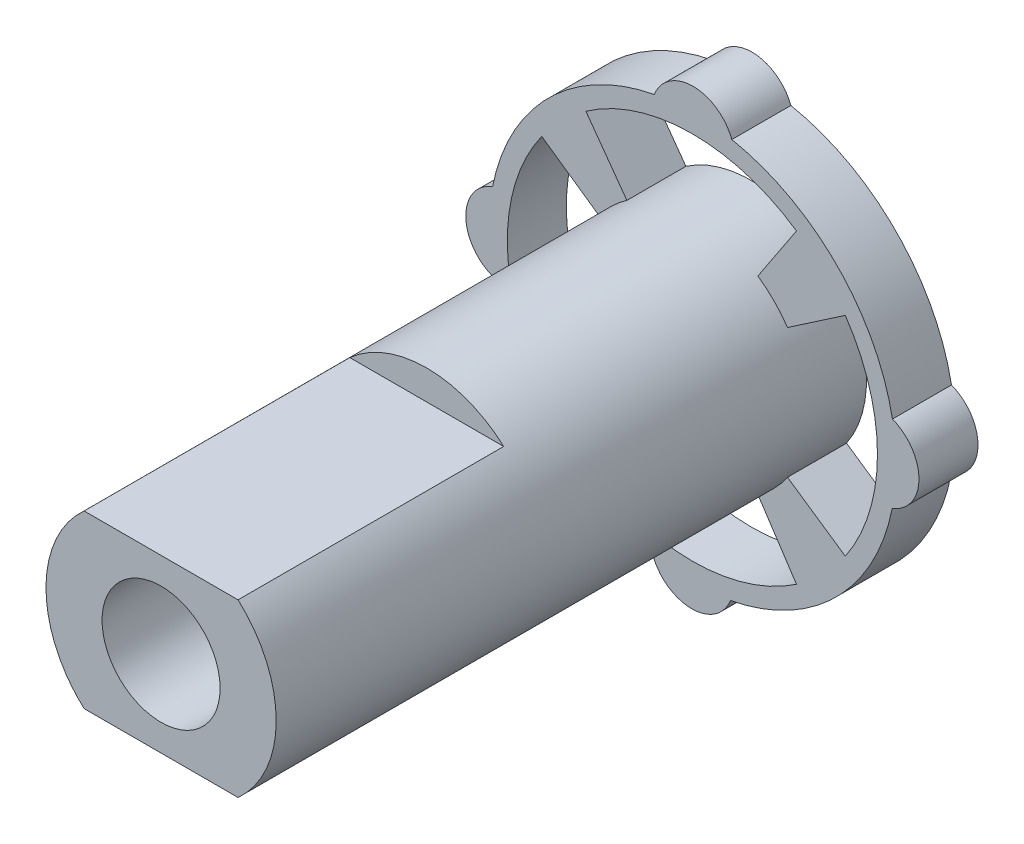
ISO-10303-21;
HEADER;
FILE_DESCRIPTION(('STEP AP214'),'2;1');
FILE_NAME('part.step','',(''),(''),'','','');
FILE_SCHEMA(('AUTOMOTIVE_DESIGN { 1 0 10303 214 1 1 1 1 }'));
ENDSEC;
DATA;
#1=APPLICATION_CONTEXT('core data for automotive mechanical design processes');
#2=APPLICATION_PROTOCOL_DEFINITION('international standard','automotive_design',2000,#1);
#3=PRODUCT_CONTEXT('',#1,'mechanical');
#4=PRODUCT('Part','Part','',(#3));
#5=PRODUCT_RELATED_PRODUCT_CATEGORY('part','',(#4));
#6=PRODUCT_DEFINITION_FORMATION('','',#4);
#7=PRODUCT_DEFINITION_CONTEXT('part definition',#1,'design');
#8=PRODUCT_DEFINITION('design','',#6,#7);
#9=PRODUCT_DEFINITION_SHAPE('','',#8);
#10=(LENGTH_UNIT() NAMED_UNIT(*) SI_UNIT(.MILLI.,.METRE.));
#11=(NAMED_UNIT(*) PLANE_ANGLE_UNIT() SI_UNIT($,.RADIAN.));
#12=(NAMED_UNIT(*) SI_UNIT($,.STERADIAN.) SOLID_ANGLE_UNIT());
#13=UNCERTAINTY_MEASURE_WITH_UNIT(LENGTH_MEASURE(1.E-05),#10,'distance_accuracy_value','');
#14=(GEOMETRIC_REPRESENTATION_CONTEXT(3) GLOBAL_UNCERTAINTY_ASSIGNED_CONTEXT((#13)) GLOBAL_UNIT_ASSIGNED_CONTEXT((#10,
#11,#12)) REPRESENTATION_CONTEXT('',''));
#15=CARTESIAN_POINT('',(0.,0.,0.));
#16=DIRECTION('',(0.,0.,1.));
#17=DIRECTION('',(1.,0.,0.));
#18=AXIS2_PLACEMENT_3D('',#15,#16,#17);
#19=CARTESIAN_POINT('',(0.,0.,5.));
#20=DIRECTION('',(0.,0.,-1.));
#21=DIRECTION('',(-1.,0.,0.));
#22=AXIS2_PLACEMENT_3D('',#19,#20,#21);
#23=CYLINDRICAL_SURFACE('',#22,1.95);
#24=CARTESIAN_POINT('',(0.,0.,5.));
#25=DIRECTION('',(0.,0.,1.));
#26=DIRECTION('',(1.,0.,0.));
#27=AXIS2_PLACEMENT_3D('',#24,#25,#26);
#28=CIRCLE('',#27,1.95);
#29=CARTESIAN_POINT('',(-1.30384048104053,1.45,5.));
#30=VERTEX_POINT('',#29);
#31=CARTESIAN_POINT('',(-1.30384048104053,-1.45,5.));
#32=VERTEX_POINT('',#31);
#33=EDGE_CURVE('E226',#30,#32,#28,.T.);
#34=ORIENTED_EDGE('',*,*,#33,.F.);
#35=DIRECTION('',(0.,0.,-1.));
#36=VECTOR('',#35,1.);
#37=CARTESIAN_POINT('',(-1.30384048104053,1.45,5.));
#38=LINE('',#37,#36);
#39=CARTESIAN_POINT('',(-1.30384048104053,1.45,0.5));
#40=VERTEX_POINT('',#39);
#41=EDGE_CURVE('E56',#30,#40,#38,.T.);
#42=ORIENTED_EDGE('',*,*,#41,.T.);
#43=CARTESIAN_POINT('',(0.,0.,0.5));
#44=DIRECTION('',(0.,0.,1.));
#45=DIRECTION('',(1.,0.,0.));
#46=AXIS2_PLACEMENT_3D('',#43,#44,#45);
#47=CIRCLE('',#46,1.95);
#48=CARTESIAN_POINT('',(1.30384048104053,1.45,0.5));
#49=VERTEX_POINT('',#48);
#50=EDGE_CURVE('E11',#49,#40,#47,.T.);
#51=ORIENTED_EDGE('',*,*,#50,.F.);
#52=DIRECTION('',(0.,0.,-1.));
#53=VECTOR('',#52,1.);
#54=CARTESIAN_POINT('',(1.30384048104053,1.45,5.));
#55=LINE('',#54,#53);
#56=CARTESIAN_POINT('',(1.30384048104053,1.45,5.));
#57=VERTEX_POINT('',#56);
#58=EDGE_CURVE('E252',#49,#57,#55,.F.);
#59=ORIENTED_EDGE('',*,*,#58,.T.);
#60=CARTESIAN_POINT('',(1.30384048104053,-1.45,5.));
#61=VERTEX_POINT('',#60);
#62=EDGE_CURVE('E236',#61,#57,#28,.T.);
#63=ORIENTED_EDGE('',*,*,#62,.F.);
#64=DIRECTION('',(0.,0.,-1.));
#65=VECTOR('',#64,1.);
#66=CARTESIAN_POINT('',(1.30384048104053,-1.45,5.));
#67=LINE('',#66,#65);
#68=CARTESIAN_POINT('',(1.30384048104053,-1.45,0.5));
#69=VERTEX_POINT('',#68);
#70=EDGE_CURVE('E48',#61,#69,#67,.T.);
#71=ORIENTED_EDGE('',*,*,#70,.T.);
#72=CARTESIAN_POINT('',(0.,0.,0.5));
#73=DIRECTION('',(0.,0.,1.));
#74=DIRECTION('',(1.,0.,0.));
#75=AXIS2_PLACEMENT_3D('',#72,#73,#74);
#76=CIRCLE('',#75,1.95);
#77=CARTESIAN_POINT('',(-1.30384048104053,-1.45,0.5));
#78=VERTEX_POINT('',#77);
#79=EDGE_CURVE('E41',#78,#69,#76,.T.);
#80=ORIENTED_EDGE('',*,*,#79,.F.);
#81=DIRECTION('',(0.,0.,-1.));
#82=VECTOR('',#81,1.);
#83=CARTESIAN_POINT('',(-1.30384048104053,-1.45,5.));
#84=LINE('',#83,#82);
#85=EDGE_CURVE('E219',#78,#32,#84,.F.);
#86=ORIENTED_EDGE('',*,*,#85,.T.);
#87=EDGE_LOOP('',(#34,#42,#51,#59,#63,#71,#80,#86));
#88=FACE_BOUND('',#87,.T.);
#89=DIRECTION('',(0.,0.,-1.));
#90=VECTOR('',#89,1.);
#91=CARTESIAN_POINT('',(-1.61113218441836,-1.09852313782514,-4.));
#92=LINE('',#91,#90);
#93=CARTESIAN_POINT('',(-1.61113218441712,-1.09852313782429,-4.));
#94=VERTEX_POINT('',#93);
#95=CARTESIAN_POINT('',(-1.61113218441712,-1.09852313782429,-5.));
#96=VERTEX_POINT('',#95);
#97=EDGE_CURVE('E344',#94,#96,#92,.T.);
#98=ORIENTED_EDGE('',*,*,#97,.F.);
#99=CARTESIAN_POINT('',(0.,0.,-4.));
#100=DIRECTION('',(0.,0.,-1.));
#101=DIRECTION('',(-1.,0.,0.));
#102=AXIS2_PLACEMENT_3D('',#99,#100,#101);
#103=CIRCLE('',#102,1.95000000000151);
#104=CARTESIAN_POINT('',(-1.10963609074517,-1.6034985956095,-4.));
#105=VERTEX_POINT('',#104);
#106=EDGE_CURVE('E301',#105,#94,#103,.T.);
#107=ORIENTED_EDGE('',*,*,#106,.F.);
#108=DIRECTION('',(0.,0.,-1.));
#109=VECTOR('',#108,1.);
#110=CARTESIAN_POINT('',(-1.10963609074517,-1.6034985956095,-4.));
#111=LINE('',#110,#109);
#112=CARTESIAN_POINT('',(-1.10963609074434,-1.60349859560824,-5.));
#113=VERTEX_POINT('',#112);
#114=EDGE_CURVE('E347',#105,#113,#111,.T.);
#115=ORIENTED_EDGE('',*,*,#114,.T.);
#116=CARTESIAN_POINT('',(0.,0.,-5.));
#117=DIRECTION('',(0.,0.,1.));
#118=DIRECTION('',(1.,0.,0.));
#119=AXIS2_PLACEMENT_3D('',#116,#117,#118);
#120=CIRCLE('',#119,1.95);
#121=CARTESIAN_POINT('',(1.10963609074434,-1.60349859560824,-5.));
#122=VERTEX_POINT('',#121);
#123=EDGE_CURVE('E244',#113,#122,#120,.T.);
#124=ORIENTED_EDGE('',*,*,#123,.T.);
#125=DIRECTION('',(0.,0.,-1.));
#126=VECTOR('',#125,1.);
#127=CARTESIAN_POINT('',(1.10963609074518,-1.6034985956095,-4.));
#128=LINE('',#127,#126);
#129=CARTESIAN_POINT('',(1.10963609074432,-1.60349859560826,-4.));
#130=VERTEX_POINT('',#129);
#131=EDGE_CURVE('E353',#130,#122,#128,.T.);
#132=ORIENTED_EDGE('',*,*,#131,.F.);
#133=CARTESIAN_POINT('',(0.,0.,-4.));
#134=DIRECTION('',(0.,0.,-1.));
#135=DIRECTION('',(-1.,0.,0.));
#136=AXIS2_PLACEMENT_3D('',#133,#134,#135);
#137=CIRCLE('',#136,1.95000000000151);
#138=CARTESIAN_POINT('',(1.61113218441836,-1.09852313782514,-4.));
#139=VERTEX_POINT('',#138);
#140=EDGE_CURVE('E289',#139,#130,#137,.T.);
#141=ORIENTED_EDGE('',*,*,#140,.F.);
#142=DIRECTION('',(0.,0.,-1.));
#143=VECTOR('',#142,1.);
#144=CARTESIAN_POINT('',(1.61113218441836,-1.09852313782514,-4.));
#145=LINE('',#144,#143);
#146=CARTESIAN_POINT('',(1.61113218441712,-1.09852313782429,-5.));
#147=VERTEX_POINT('',#146);
#148=EDGE_CURVE('E356',#139,#147,#145,.T.);
#149=ORIENTED_EDGE('',*,*,#148,.T.);
#150=CARTESIAN_POINT('',(1.61113218441712,1.09852313782429,-5.));
#151=VERTEX_POINT('',#150);
#152=EDGE_CURVE('E243',#147,#151,#120,.T.);
#153=ORIENTED_EDGE('',*,*,#152,.T.);
#154=DIRECTION('',(0.,0.,-1.));
#155=VECTOR('',#154,1.);
#156=CARTESIAN_POINT('',(1.61113218441836,1.09852313782514,-4.));
#157=LINE('',#156,#155);
#158=CARTESIAN_POINT('',(1.61113218441712,1.09852313782429,-4.));
#159=VERTEX_POINT('',#158);
#160=EDGE_CURVE('E362',#159,#151,#157,.T.);
#161=ORIENTED_EDGE('',*,*,#160,.F.);
#162=CARTESIAN_POINT('',(0.,0.,-4.));
#163=DIRECTION('',(0.,0.,-1.));
#164=DIRECTION('',(-1.,0.,0.));
#165=AXIS2_PLACEMENT_3D('',#162,#163,#164);
#166=CIRCLE('',#165,1.95000000000151);
#167=CARTESIAN_POINT('',(1.10963609074517,1.6034985956095,-4.));
#168=VERTEX_POINT('',#167);
#169=EDGE_CURVE('E277',#168,#159,#166,.T.);
#170=ORIENTED_EDGE('',*,*,#169,.F.);
#171=DIRECTION('',(0.,0.,-1.));
#172=VECTOR('',#171,1.);
#173=CARTESIAN_POINT('',(1.10963609074517,1.6034985956095,-4.));
#174=LINE('',#173,#172);
#175=CARTESIAN_POINT('',(1.10963609074434,1.60349859560825,-5.));
#176=VERTEX_POINT('',#175);
#177=EDGE_CURVE('E365',#168,#176,#174,.T.);
#178=ORIENTED_EDGE('',*,*,#177,.T.);
#179=CARTESIAN_POINT('',(-1.10963609074431,1.60349859560827,-5.));
#180=VERTEX_POINT('',#179);
#181=EDGE_CURVE('E238',#176,#180,#120,.T.);
#182=ORIENTED_EDGE('',*,*,#181,.T.);
#183=DIRECTION('',(0.,0.,-1.));
#184=VECTOR('',#183,1.);
#185=CARTESIAN_POINT('',(-1.10963609074519,1.60349859560949,-4.));
#186=LINE('',#185,#184);
#187=CARTESIAN_POINT('',(-1.10963609074433,1.60349859560825,-4.));
#188=VERTEX_POINT('',#187);
#189=EDGE_CURVE('E371',#188,#180,#186,.T.);
#190=ORIENTED_EDGE('',*,*,#189,.F.);
#191=CARTESIAN_POINT('',(0.,0.,-4.));
#192=DIRECTION('',(0.,0.,-1.));
#193=DIRECTION('',(-1.,0.,0.));
#194=AXIS2_PLACEMENT_3D('',#191,#192,#193);
#195=CIRCLE('',#194,1.95000000000151);
#196=CARTESIAN_POINT('',(-1.58000550504227,1.142839710564,-4.));
#197=VERTEX_POINT('',#196);
#198=EDGE_CURVE('E265',#197,#188,#195,.T.);
#199=ORIENTED_EDGE('',*,*,#198,.F.);
#200=DIRECTION('',(0.,0.,-1.));
#201=VECTOR('',#200,1.);
#202=CARTESIAN_POINT('',(-1.58000550504227,1.142839710564,-4.));
#203=LINE('',#202,#201);
#204=CARTESIAN_POINT('',(-1.58000550504103,1.14283971056314,-5.));
#205=VERTEX_POINT('',#204);
#206=EDGE_CURVE('E374',#197,#205,#203,.T.);
#207=ORIENTED_EDGE('',*,*,#206,.T.);
#208=EDGE_CURVE('E740',#205,#96,#120,.T.);
#209=ORIENTED_EDGE('',*,*,#208,.T.);
#210=EDGE_LOOP('',(#98,#107,#115,#124,#132,#141,#149,#153,#161,#170,#178,#182,#190,#199,#207,#209));
#211=FACE_BOUND('',#210,.T.);
#212=ADVANCED_FACE('F34',(#88,#211),#23,.T.);
#213=CARTESIAN_POINT('',(0.,0.,5.));
#214=DIRECTION('',(0.,0.,1.));
#215=DIRECTION('',(1.,0.,0.));
#216=AXIS2_PLACEMENT_3D('',#213,#214,#215);
#217=PLANE('',#216);
#218=DIRECTION('',(1.,0.,0.));
#219=VECTOR('',#218,1.);
#220=CARTESIAN_POINT('',(0.,1.45,5.));
#221=LINE('',#220,#219);
#222=EDGE_CURVE('E225',#30,#57,#221,.T.);
#223=ORIENTED_EDGE('',*,*,#222,.F.);
#224=ORIENTED_EDGE('',*,*,#33,.T.);
#225=DIRECTION('',(-1.,0.,0.));
#226=VECTOR('',#225,1.);
#227=CARTESIAN_POINT('',(0.,-1.45,5.));
#228=LINE('',#227,#226);
#229=EDGE_CURVE('E216',#61,#32,#228,.T.);
#230=ORIENTED_EDGE('',*,*,#229,.F.);
#231=ORIENTED_EDGE('',*,*,#62,.T.);
#232=EDGE_LOOP('',(#223,#224,#230,#231));
#233=FACE_BOUND('',#232,.T.);
#234=CARTESIAN_POINT('',(0.,0.,5.));
#235=DIRECTION('',(0.,0.,1.));
#236=DIRECTION('',(1.,0.,0.));
#237=AXIS2_PLACEMENT_3D('',#234,#235,#236);
#238=CIRCLE('',#237,1.);
#239=CARTESIAN_POINT('',(1.,0.,5.));
#240=VERTEX_POINT('',#239);
#241=EDGE_CURVE('E245',#240,#240,#238,.T.);
#242=ORIENTED_EDGE('',*,*,#241,.F.);
#243=EDGE_LOOP('',(#242));
#244=FACE_BOUND('',#243,.T.);
#245=ADVANCED_FACE('F234',(#233,#244),#217,.T.);
#246=CARTESIAN_POINT('',(0.,0.,-5.));
#247=DIRECTION('',(0.,0.,1.));
#248=DIRECTION('',(1.,0.,0.));
#249=AXIS2_PLACEMENT_3D('',#246,#247,#248);
#250=PLANE('',#249);
#251=ORIENTED_EDGE('',*,*,#181,.F.);
#252=DIRECTION('',(-0.551703079768003,-0.834040593601115,0.));
#253=VECTOR('',#252,1.);
#254=CARTESIAN_POINT('',(1.76362712142383,2.59217364100965,-5.));
#255=LINE('',#254,#253);
#256=CARTESIAN_POINT('',(1.76362712142383,2.59217364100965,-5.));
#257=VERTEX_POINT('',#256);
#258=EDGE_CURVE('E318',#257,#176,#255,.T.);
#259=ORIENTED_EDGE('',*,*,#258,.F.);
#260=CARTESIAN_POINT('',(0.,0.,-5.));
#261=DIRECTION('',(0.,0.,-1.));
#262=DIRECTION('',(-1.,0.,0.));
#263=AXIS2_PLACEMENT_3D('',#260,#261,#262);
#264=CIRCLE('',#263,3.13524238434079);
#265=CARTESIAN_POINT('',(-1.80412222564376,2.56415440321077,-5.));
#266=VERTEX_POINT('',#265);
#267=EDGE_CURVE('E315',#266,#257,#264,.T.);
#268=ORIENTED_EDGE('',*,*,#267,.F.);
#269=DIRECTION('',(-0.585867027483964,0.810407197714275,0.));
#270=VECTOR('',#269,1.);
#271=CARTESIAN_POINT('',(-1.80412222564376,2.56415440321077,-5.));
#272=LINE('',#271,#270);
#273=EDGE_CURVE('E312',#180,#266,#272,.T.);
#274=ORIENTED_EDGE('',*,*,#273,.F.);
#275=EDGE_LOOP('',(#251,#259,#268,#274));
#276=FACE_BOUND('',#275,.T.);
#277=DIRECTION('',(0.826042146891024,0.563608349441053,0.));
#278=VECTOR('',#277,1.);
#279=CARTESIAN_POINT('',(2.5901923790567,1.76653566282811,-5.));
#280=LINE('',#279,#278);
#281=CARTESIAN_POINT('',(2.5901923790567,1.76653566282811,-5.));
#282=VERTEX_POINT('',#281);
#283=EDGE_CURVE('E321',#151,#282,#280,.T.);
#284=ORIENTED_EDGE('',*,*,#283,.F.);
#285=ORIENTED_EDGE('',*,*,#152,.F.);
#286=DIRECTION('',(-0.826042146891024,0.563608349441053,0.));
#287=VECTOR('',#286,1.);
#288=CARTESIAN_POINT('',(2.5901923790567,-1.76653566282811,-5.));
#289=LINE('',#288,#287);
#290=CARTESIAN_POINT('',(2.5901923790567,-1.76653566282811,-5.));
#291=VERTEX_POINT('',#290);
#292=EDGE_CURVE('E327',#291,#147,#289,.T.);
#293=ORIENTED_EDGE('',*,*,#292,.F.);
#294=CARTESIAN_POINT('',(0.,0.,-5.));
#295=DIRECTION('',(0.,0.,-1.));
#296=DIRECTION('',(-1.,0.,0.));
#297=AXIS2_PLACEMENT_3D('',#294,#295,#296);
#298=CIRCLE('',#297,3.13524238434079);
#299=EDGE_CURVE('E324',#282,#291,#298,.T.);
#300=ORIENTED_EDGE('',*,*,#299,.F.);
#301=EDGE_LOOP('',(#284,#285,#293,#300));
#302=FACE_BOUND('',#301,.T.);
#303=DIRECTION('',(-0.826042146891024,-0.563608349441053,0.));
#304=VECTOR('',#303,1.);
#305=CARTESIAN_POINT('',(-2.5901923790567,-1.76653566282811,-5.));
#306=LINE('',#305,#304);
#307=CARTESIAN_POINT('',(-2.5901923790567,-1.76653566282811,-5.));
#308=VERTEX_POINT('',#307);
#309=EDGE_CURVE('E262',#96,#308,#306,.T.);
#310=ORIENTED_EDGE('',*,*,#309,.F.);
#311=ORIENTED_EDGE('',*,*,#208,.F.);
#312=DIRECTION('',(0.819868118333045,-0.5725524155403,0.));
#313=VECTOR('',#312,1.);
#314=CARTESIAN_POINT('',(-2.55183108765546,1.82151116072401,-5.));
#315=LINE('',#314,#313);
#316=CARTESIAN_POINT('',(-2.55183108765546,1.82151116072401,-5.));
#317=VERTEX_POINT('',#316);
#318=EDGE_CURVE('E309',#317,#205,#315,.T.);
#319=ORIENTED_EDGE('',*,*,#318,.F.);
#320=CARTESIAN_POINT('',(0.,0.,-5.));
#321=DIRECTION('',(0.,0.,-1.));
#322=DIRECTION('',(-1.,0.,0.));
#323=AXIS2_PLACEMENT_3D('',#320,#321,#322);
#324=CIRCLE('',#323,3.13524238434079);
#325=EDGE_CURVE('E257',#308,#317,#324,.T.);
#326=ORIENTED_EDGE('',*,*,#325,.F.);
#327=EDGE_LOOP('',(#310,#311,#319,#326));
#328=FACE_BOUND('',#327,.T.);
#329=ORIENTED_EDGE('',*,*,#123,.F.);
#330=DIRECTION('',(0.551703079768001,0.834040593601116,0.));
#331=VECTOR('',#330,1.);
#332=CARTESIAN_POINT('',(-1.76362712142383,-2.59217364100965,-5.));
#333=LINE('',#332,#331);
#334=CARTESIAN_POINT('',(-1.76362712142383,-2.59217364100965,-5.));
#335=VERTEX_POINT('',#334);
#336=EDGE_CURVE('E336',#335,#113,#333,.T.);
#337=ORIENTED_EDGE('',*,*,#336,.F.);
#338=CARTESIAN_POINT('',(0.,0.,-5.));
#339=DIRECTION('',(0.,0.,-1.));
#340=DIRECTION('',(-1.,0.,0.));
#341=AXIS2_PLACEMENT_3D('',#338,#339,#340);
#342=CIRCLE('',#341,3.13524238434079);
#343=CARTESIAN_POINT('',(1.76362712142383,-2.59217364100965,-5.));
#344=VERTEX_POINT('',#343);
#345=EDGE_CURVE('E333',#344,#335,#342,.T.);
#346=ORIENTED_EDGE('',*,*,#345,.F.);
#347=DIRECTION('',(0.551703079768001,-0.834040593601116,0.));
#348=VECTOR('',#347,1.);
#349=CARTESIAN_POINT('',(1.76362712142383,-2.59217364100965,-5.));
#350=LINE('',#349,#348);
#351=EDGE_CURVE('E330',#122,#344,#350,.T.);
#352=ORIENTED_EDGE('',*,*,#351,.F.);
#353=EDGE_LOOP('',(#329,#337,#346,#352));
#354=FACE_BOUND('',#353,.T.);
#355=CARTESIAN_POINT('',(0.,0.,-5.));
#356=DIRECTION('',(0.,0.,1.));
#357=DIRECTION('',(1.,0.,0.));
#358=AXIS2_PLACEMENT_3D('',#355,#356,#357);
#359=CIRCLE('',#358,1.);
#360=CARTESIAN_POINT('',(1.,0.,-5.));
#361=VERTEX_POINT('',#360);
#362=EDGE_CURVE('E241',#361,#361,#359,.T.);
#363=ORIENTED_EDGE('',*,*,#362,.T.);
#364=EDGE_LOOP('',(#363));
#365=FACE_BOUND('',#364,.T.);
#366=CARTESIAN_POINT('',(0.0107524234147472,3.13522394638059,-5.));
#367=DIRECTION('',(0.,0.,-1.));
#368=DIRECTION('',(1.,0.,0.));
#369=AXIS2_PLACEMENT_3D('',#366,#367,#368);
#370=CIRCLE('',#369,0.703048313630898);
#371=CARTESIAN_POINT('',(-0.644816381619679,3.38920519207598,-5.));
#372=VERTEX_POINT('',#371);
#373=CARTESIAN_POINT('',(0.668047872114337,3.38470265172042,-5.));
#374=VERTEX_POINT('',#373);
#375=EDGE_CURVE('E343',#372,#374,#370,.T.);
#376=ORIENTED_EDGE('',*,*,#375,.T.);
#377=CARTESIAN_POINT('',(0.,0.,-5.));
#378=DIRECTION('',(0.,0.,-1.));
#379=DIRECTION('',(-1.,0.,0.));
#380=AXIS2_PLACEMENT_3D('',#377,#378,#379);
#381=CIRCLE('',#380,3.44999999999997);
#382=CARTESIAN_POINT('',(3.38920519207596,0.644816381619676,-5.));
#383=VERTEX_POINT('',#382);
#384=EDGE_CURVE('E406',#374,#383,#381,.T.);
#385=ORIENTED_EDGE('',*,*,#384,.T.);
#386=CARTESIAN_POINT('',(3.13522394638056,-0.0107524234147479,-5.));
#387=DIRECTION('',(0.,0.,-1.));
#388=DIRECTION('',(1.,0.,0.));
#389=AXIS2_PLACEMENT_3D('',#386,#387,#388);
#390=CIRCLE('',#389,0.703048313630889);
#391=CARTESIAN_POINT('',(3.38470265172039,-0.66804787211434,-5.));
#392=VERTEX_POINT('',#391);
#393=EDGE_CURVE('E409',#383,#392,#390,.T.);
#394=ORIENTED_EDGE('',*,*,#393,.T.);
#395=CARTESIAN_POINT('',(0.,0.,-5.));
#396=DIRECTION('',(0.,0.,-1.));
#397=DIRECTION('',(-1.,0.,0.));
#398=AXIS2_PLACEMENT_3D('',#395,#396,#397);
#399=CIRCLE('',#398,3.44999999999995);
#400=CARTESIAN_POINT('',(0.644816381619673,-3.38920519207595,-5.));
#401=VERTEX_POINT('',#400);
#402=EDGE_CURVE('E412',#392,#401,#399,.T.);
#403=ORIENTED_EDGE('',*,*,#402,.T.);
#404=CARTESIAN_POINT('',(-0.0107524234147477,-3.13522394638056,-5.));
#405=DIRECTION('',(0.,0.,-1.));
#406=DIRECTION('',(1.,0.,0.));
#407=AXIS2_PLACEMENT_3D('',#404,#405,#406);
#408=CIRCLE('',#407,0.703048313630898);
#409=CARTESIAN_POINT('',(-0.668047872114338,-3.38470265172042,-5.));
#410=VERTEX_POINT('',#409);
#411=EDGE_CURVE('E415',#401,#410,#408,.T.);
#412=ORIENTED_EDGE('',*,*,#411,.T.);
#413=CARTESIAN_POINT('',(0.,0.,-5.));
#414=DIRECTION('',(0.,0.,-1.));
#415=DIRECTION('',(-1.,0.,0.));
#416=AXIS2_PLACEMENT_3D('',#413,#414,#415);
#417=CIRCLE('',#416,3.44999999999997);
#418=CARTESIAN_POINT('',(-3.38920519207596,-0.644816381619676,-5.));
#419=VERTEX_POINT('',#418);
#420=EDGE_CURVE('E418',#410,#419,#417,.T.);
#421=ORIENTED_EDGE('',*,*,#420,.T.);
#422=CARTESIAN_POINT('',(-3.13522394638058,0.0107524234147872,-5.));
#423=DIRECTION('',(0.,0.,-1.));
#424=DIRECTION('',(1.,0.,0.));
#425=AXIS2_PLACEMENT_3D('',#422,#423,#424);
#426=CIRCLE('',#425,0.703048313630892);
#427=CARTESIAN_POINT('',(-3.38470265172044,0.668047872114372,-5.));
#428=VERTEX_POINT('',#427);
#429=EDGE_CURVE('E421',#419,#428,#426,.T.);
#430=ORIENTED_EDGE('',*,*,#429,.T.);
#431=CARTESIAN_POINT('',(0.,0.,-5.));
#432=DIRECTION('',(0.,0.,-1.));
#433=DIRECTION('',(-1.,0.,0.));
#434=AXIS2_PLACEMENT_3D('',#431,#432,#433);
#435=CIRCLE('',#434,3.44999999999998);
#436=EDGE_CURVE('E382',#428,#372,#435,.T.);
#437=ORIENTED_EDGE('',*,*,#436,.T.);
#438=EDGE_LOOP('',(#376,#385,#394,#403,#412,#421,#430,#437));
#439=FACE_BOUND('',#438,.T.);
#440=ADVANCED_FACE('F446',(#276,#302,#328,#354,#365,#439),#250,.F.);
#441=CARTESIAN_POINT('',(0.,0.,5.));
#442=DIRECTION('',(0.,0.,-1.));
#443=DIRECTION('',(-1.,0.,0.));
#444=AXIS2_PLACEMENT_3D('',#441,#442,#443);
#445=CYLINDRICAL_SURFACE('',#444,1.);
#446=ORIENTED_EDGE('',*,*,#241,.T.);
#447=EDGE_LOOP('',(#446));
#448=FACE_BOUND('',#447,.T.);
#449=ORIENTED_EDGE('',*,*,#362,.F.);
#450=EDGE_LOOP('',(#449));
#451=FACE_BOUND('',#450,.T.);
#452=ADVANCED_FACE('F449',(#448,#451),#445,.F.);
#453=CARTESIAN_POINT('',(0.0107524234147472,3.13522394638059,-4.));
#454=DIRECTION('',(0.,0.,-1.));
#455=DIRECTION('',(-1.,0.,0.));
#456=AXIS2_PLACEMENT_3D('',#453,#454,#455);
#457=CYLINDRICAL_SURFACE('',#456,0.703048313630898);
#458=ORIENTED_EDGE('',*,*,#375,.F.);
#459=DIRECTION('',(0.,0.,-1.));
#460=VECTOR('',#459,1.);
#461=CARTESIAN_POINT('',(-0.644816381619679,3.38920519207598,-4.));
#462=LINE('',#461,#460);
#463=CARTESIAN_POINT('',(-0.644816381619679,3.38920519207598,-4.));
#464=VERTEX_POINT('',#463);
#465=EDGE_CURVE('E426',#464,#372,#462,.T.);
#466=ORIENTED_EDGE('',*,*,#465,.F.);
#467=CARTESIAN_POINT('',(0.0107524234147472,3.13522394638059,-4.));
#468=DIRECTION('',(0.,0.,-1.));
#469=DIRECTION('',(1.,0.,0.));
#470=AXIS2_PLACEMENT_3D('',#467,#468,#469);
#471=CIRCLE('',#470,0.703048313630898);
#472=CARTESIAN_POINT('',(0.668047872114337,3.38470265172042,-4.));
#473=VERTEX_POINT('',#472);
#474=EDGE_CURVE('E378',#464,#473,#471,.T.);
#475=ORIENTED_EDGE('',*,*,#474,.T.);
#476=DIRECTION('',(0.,0.,-1.));
#477=VECTOR('',#476,1.);
#478=CARTESIAN_POINT('',(0.668047872114337,3.38470265172042,-4.));
#479=LINE('',#478,#477);
#480=EDGE_CURVE('E403',#473,#374,#479,.T.);
#481=ORIENTED_EDGE('',*,*,#480,.T.);
#482=EDGE_LOOP('',(#458,#466,#475,#481));
#483=FACE_BOUND('',#482,.T.);
#484=ADVANCED_FACE('F451',(#483),#457,.T.);
#485=CARTESIAN_POINT('',(0.,0.,-4.));
#486=DIRECTION('',(0.,0.,-1.));
#487=DIRECTION('',(-1.,0.,0.));
#488=AXIS2_PLACEMENT_3D('',#485,#486,#487);
#489=CYLINDRICAL_SURFACE('',#488,3.44999999999998);
#490=ORIENTED_EDGE('',*,*,#436,.F.);
#491=DIRECTION('',(0.,0.,-1.));
#492=VECTOR('',#491,1.);
#493=CARTESIAN_POINT('',(-3.38470265172044,0.668047872114372,-4.));
#494=LINE('',#493,#492);
#495=CARTESIAN_POINT('',(-3.38470265172044,0.668047872114372,-4.));
#496=VERTEX_POINT('',#495);
#497=EDGE_CURVE('E428',#496,#428,#494,.T.);
#498=ORIENTED_EDGE('',*,*,#497,.F.);
#499=CARTESIAN_POINT('',(0.,0.,-4.));
#500=DIRECTION('',(0.,0.,-1.));
#501=DIRECTION('',(-1.,0.,0.));
#502=AXIS2_PLACEMENT_3D('',#499,#500,#501);
#503=CIRCLE('',#502,3.44999999999998);
#504=EDGE_CURVE('E400',#496,#464,#503,.T.);
#505=ORIENTED_EDGE('',*,*,#504,.T.);
#506=ORIENTED_EDGE('',*,*,#465,.T.);
#507=EDGE_LOOP('',(#490,#498,#505,#506));
#508=FACE_BOUND('',#507,.T.);
#509=ADVANCED_FACE('F457',(#508),#489,.T.);
#510=CARTESIAN_POINT('',(-3.13522394638058,0.0107524234147872,-4.));
#511=DIRECTION('',(0.,0.,-1.));
#512=DIRECTION('',(-1.,0.,0.));
#513=AXIS2_PLACEMENT_3D('',#510,#511,#512);
#514=CYLINDRICAL_SURFACE('',#513,0.703048313630892);
#515=ORIENTED_EDGE('',*,*,#429,.F.);
#516=DIRECTION('',(0.,0.,-1.));
#517=VECTOR('',#516,1.);
#518=CARTESIAN_POINT('',(-3.38920519207596,-0.644816381619676,-4.));
#519=LINE('',#518,#517);
#520=CARTESIAN_POINT('',(-3.38920519207596,-0.644816381619676,-4.));
#521=VERTEX_POINT('',#520);
#522=EDGE_CURVE('E430',#521,#419,#519,.T.);
#523=ORIENTED_EDGE('',*,*,#522,.F.);
#524=CARTESIAN_POINT('',(-3.13522394638058,0.0107524234147872,-4.));
#525=DIRECTION('',(0.,0.,-1.));
#526=DIRECTION('',(1.,0.,0.));
#527=AXIS2_PLACEMENT_3D('',#524,#525,#526);
#528=CIRCLE('',#527,0.703048313630892);
#529=EDGE_CURVE('E397',#521,#496,#528,.T.);
#530=ORIENTED_EDGE('',*,*,#529,.T.);
#531=ORIENTED_EDGE('',*,*,#497,.T.);
#532=EDGE_LOOP('',(#515,#523,#530,#531));
#533=FACE_BOUND('',#532,.T.);
#534=ADVANCED_FACE('F492',(#533),#514,.T.);
#535=CARTESIAN_POINT('',(0.,0.,-4.));
#536=DIRECTION('',(0.,0.,-1.));
#537=DIRECTION('',(-1.,0.,0.));
#538=AXIS2_PLACEMENT_3D('',#535,#536,#537);
#539=CYLINDRICAL_SURFACE('',#538,3.44999999999997);
#540=ORIENTED_EDGE('',*,*,#420,.F.);
#541=DIRECTION('',(0.,0.,-1.));
#542=VECTOR('',#541,1.);
#543=CARTESIAN_POINT('',(-0.668047872114338,-3.38470265172042,-4.));
#544=LINE('',#543,#542);
#545=CARTESIAN_POINT('',(-0.668047872114338,-3.38470265172042,-4.));
#546=VERTEX_POINT('',#545);
#547=EDGE_CURVE('E432',#546,#410,#544,.T.);
#548=ORIENTED_EDGE('',*,*,#547,.F.);
#549=CARTESIAN_POINT('',(0.,0.,-4.));
#550=DIRECTION('',(0.,0.,-1.));
#551=DIRECTION('',(-1.,0.,0.));
#552=AXIS2_PLACEMENT_3D('',#549,#550,#551);
#553=CIRCLE('',#552,3.44999999999997);
#554=EDGE_CURVE('E394',#546,#521,#553,.T.);
#555=ORIENTED_EDGE('',*,*,#554,.T.);
#556=ORIENTED_EDGE('',*,*,#522,.T.);
#557=EDGE_LOOP('',(#540,#548,#555,#556));
#558=FACE_BOUND('',#557,.T.);
#559=ADVANCED_FACE('F502',(#558),#539,.T.);
#560=CARTESIAN_POINT('',(-0.0107524234147477,-3.13522394638056,-4.));
#561=DIRECTION('',(0.,0.,-1.));
#562=DIRECTION('',(-1.,0.,0.));
#563=AXIS2_PLACEMENT_3D('',#560,#561,#562);
#564=CYLINDRICAL_SURFACE('',#563,0.703048313630898);
#565=ORIENTED_EDGE('',*,*,#411,.F.);
#566=DIRECTION('',(0.,0.,-1.));
#567=VECTOR('',#566,1.);
#568=CARTESIAN_POINT('',(0.644816381619673,-3.38920519207595,-4.));
#569=LINE('',#568,#567);
#570=CARTESIAN_POINT('',(0.644816381619673,-3.38920519207595,-4.));
#571=VERTEX_POINT('',#570);
#572=EDGE_CURVE('E434',#571,#401,#569,.T.);
#573=ORIENTED_EDGE('',*,*,#572,.F.);
#574=CARTESIAN_POINT('',(-0.0107524234147477,-3.13522394638056,-4.));
#575=DIRECTION('',(0.,0.,-1.));
#576=DIRECTION('',(1.,0.,0.));
#577=AXIS2_PLACEMENT_3D('',#574,#575,#576);
#578=CIRCLE('',#577,0.703048313630898);
#579=EDGE_CURVE('E391',#571,#546,#578,.T.);
#580=ORIENTED_EDGE('',*,*,#579,.T.);
#581=ORIENTED_EDGE('',*,*,#547,.T.);
#582=EDGE_LOOP('',(#565,#573,#580,#581));
#583=FACE_BOUND('',#582,.T.);
#584=ADVANCED_FACE('F512',(#583),#564,.T.);
#585=CARTESIAN_POINT('',(0.,0.,-4.));
#586=DIRECTION('',(0.,0.,-1.));
#587=DIRECTION('',(-1.,0.,0.));
#588=AXIS2_PLACEMENT_3D('',#585,#586,#587);
#589=CYLINDRICAL_SURFACE('',#588,3.44999999999995);
#590=ORIENTED_EDGE('',*,*,#402,.F.);
#591=DIRECTION('',(0.,0.,-1.));
#592=VECTOR('',#591,1.);
#593=CARTESIAN_POINT('',(3.38470265172039,-0.66804787211434,-4.));
#594=LINE('',#593,#592);
#595=CARTESIAN_POINT('',(3.38470265172039,-0.66804787211434,-4.));
#596=VERTEX_POINT('',#595);
#597=EDGE_CURVE('E436',#596,#392,#594,.T.);
#598=ORIENTED_EDGE('',*,*,#597,.F.);
#599=CARTESIAN_POINT('',(0.,0.,-4.));
#600=DIRECTION('',(0.,0.,-1.));
#601=DIRECTION('',(-1.,0.,0.));
#602=AXIS2_PLACEMENT_3D('',#599,#600,#601);
#603=CIRCLE('',#602,3.44999999999995);
#604=EDGE_CURVE('E388',#596,#571,#603,.T.);
#605=ORIENTED_EDGE('',*,*,#604,.T.);
#606=ORIENTED_EDGE('',*,*,#572,.T.);
#607=EDGE_LOOP('',(#590,#598,#605,#606));
#608=FACE_BOUND('',#607,.T.);
#609=ADVANCED_FACE('F522',(#608),#589,.T.);
#610=CARTESIAN_POINT('',(3.13522394638056,-0.0107524234147479,-4.));
#611=DIRECTION('',(0.,0.,-1.));
#612=DIRECTION('',(-1.,0.,0.));
#613=AXIS2_PLACEMENT_3D('',#610,#611,#612);
#614=CYLINDRICAL_SURFACE('',#613,0.703048313630889);
#615=ORIENTED_EDGE('',*,*,#393,.F.);
#616=DIRECTION('',(0.,0.,-1.));
#617=VECTOR('',#616,1.);
#618=CARTESIAN_POINT('',(3.38920519207596,0.644816381619676,-4.));
#619=LINE('',#618,#617);
#620=CARTESIAN_POINT('',(3.38920519207596,0.644816381619676,-4.));
#621=VERTEX_POINT('',#620);
#622=EDGE_CURVE('E438',#621,#383,#619,.T.);
#623=ORIENTED_EDGE('',*,*,#622,.F.);
#624=CARTESIAN_POINT('',(3.13522394638056,-0.0107524234147479,-4.));
#625=DIRECTION('',(0.,0.,-1.));
#626=DIRECTION('',(1.,0.,0.));
#627=AXIS2_PLACEMENT_3D('',#624,#625,#626);
#628=CIRCLE('',#627,0.703048313630889);
#629=EDGE_CURVE('E385',#621,#596,#628,.T.);
#630=ORIENTED_EDGE('',*,*,#629,.T.);
#631=ORIENTED_EDGE('',*,*,#597,.T.);
#632=EDGE_LOOP('',(#615,#623,#630,#631));
#633=FACE_BOUND('',#632,.T.);
#634=ADVANCED_FACE('F532',(#633),#614,.T.);
#635=CARTESIAN_POINT('',(0.,0.,-4.));
#636=DIRECTION('',(0.,0.,-1.));
#637=DIRECTION('',(-1.,0.,0.));
#638=AXIS2_PLACEMENT_3D('',#635,#636,#637);
#639=CYLINDRICAL_SURFACE('',#638,3.44999999999997);
#640=ORIENTED_EDGE('',*,*,#384,.F.);
#641=ORIENTED_EDGE('',*,*,#480,.F.);
#642=CARTESIAN_POINT('',(0.,0.,-4.));
#643=DIRECTION('',(0.,0.,-1.));
#644=DIRECTION('',(-1.,0.,0.));
#645=AXIS2_PLACEMENT_3D('',#642,#643,#644);
#646=CIRCLE('',#645,3.44999999999997);
#647=EDGE_CURVE('E381',#473,#621,#646,.T.);
#648=ORIENTED_EDGE('',*,*,#647,.T.);
#649=ORIENTED_EDGE('',*,*,#622,.T.);
#650=EDGE_LOOP('',(#640,#641,#648,#649));
#651=FACE_BOUND('',#650,.T.);
#652=ADVANCED_FACE('F542',(#651),#639,.T.);
#653=CARTESIAN_POINT('',(0.00537621170737362,1.56761197319029,-4.));
#654=DIRECTION('',(0.,0.,1.));
#655=DIRECTION('',(1.,0.,0.));
#656=AXIS2_PLACEMENT_3D('',#653,#654,#655);
#657=PLANE('',#656);
#658=CARTESIAN_POINT('',(0.,0.,-4.));
#659=DIRECTION('',(0.,0.,-1.));
#660=DIRECTION('',(-1.,0.,0.));
#661=AXIS2_PLACEMENT_3D('',#658,#659,#660);
#662=CIRCLE('',#661,3.13524238434079);
#663=CARTESIAN_POINT('',(-2.5901923790567,-1.76653566282811,-4.));
#664=VERTEX_POINT('',#663);
#665=CARTESIAN_POINT('',(-2.55183108765546,1.82151116072401,-4.));
#666=VERTEX_POINT('',#665);
#667=EDGE_CURVE('E258',#664,#666,#662,.T.);
#668=ORIENTED_EDGE('',*,*,#667,.T.);
#669=DIRECTION('',(0.819868118333045,-0.5725524155403,0.));
#670=VECTOR('',#669,1.);
#671=CARTESIAN_POINT('',(-2.55183108765546,1.82151116072401,-4.));
#672=LINE('',#671,#670);
#673=EDGE_CURVE('E261',#666,#197,#672,.T.);
#674=ORIENTED_EDGE('',*,*,#673,.T.);
#675=ORIENTED_EDGE('',*,*,#198,.T.);
#676=DIRECTION('',(-0.585867027483964,0.810407197714275,0.));
#677=VECTOR('',#676,1.);
#678=CARTESIAN_POINT('',(-1.80412222564376,2.56415440321077,-4.));
#679=LINE('',#678,#677);
#680=CARTESIAN_POINT('',(-1.80412222564376,2.56415440321077,-4.));
#681=VERTEX_POINT('',#680);
#682=EDGE_CURVE('E268',#188,#681,#679,.T.);
#683=ORIENTED_EDGE('',*,*,#682,.T.);
#684=CARTESIAN_POINT('',(0.,0.,-4.));
#685=DIRECTION('',(0.,0.,-1.));
#686=DIRECTION('',(-1.,0.,0.));
#687=AXIS2_PLACEMENT_3D('',#684,#685,#686);
#688=CIRCLE('',#687,3.13524238434079);
#689=CARTESIAN_POINT('',(1.76362712142383,2.59217364100965,-4.));
#690=VERTEX_POINT('',#689);
#691=EDGE_CURVE('E271',#681,#690,#688,.T.);
#692=ORIENTED_EDGE('',*,*,#691,.T.);
#693=DIRECTION('',(-0.551703079768003,-0.834040593601115,0.));
#694=VECTOR('',#693,1.);
#695=CARTESIAN_POINT('',(1.76362712142383,2.59217364100965,-4.));
#696=LINE('',#695,#694);
#697=EDGE_CURVE('E274',#690,#168,#696,.T.);
#698=ORIENTED_EDGE('',*,*,#697,.T.);
#699=ORIENTED_EDGE('',*,*,#169,.T.);
#700=DIRECTION('',(0.826042146891024,0.563608349441053,0.));
#701=VECTOR('',#700,1.);
#702=CARTESIAN_POINT('',(2.5901923790567,1.76653566282811,-4.));
#703=LINE('',#702,#701);
#704=CARTESIAN_POINT('',(2.5901923790567,1.76653566282811,-4.));
#705=VERTEX_POINT('',#704);
#706=EDGE_CURVE('E280',#159,#705,#703,.T.);
#707=ORIENTED_EDGE('',*,*,#706,.T.);
#708=CARTESIAN_POINT('',(0.,0.,-4.));
#709=DIRECTION('',(0.,0.,-1.));
#710=DIRECTION('',(-1.,0.,0.));
#711=AXIS2_PLACEMENT_3D('',#708,#709,#710);
#712=CIRCLE('',#711,3.13524238434079);
#713=CARTESIAN_POINT('',(2.5901923790567,-1.76653566282811,-4.));
#714=VERTEX_POINT('',#713);
#715=EDGE_CURVE('E283',#705,#714,#712,.T.);
#716=ORIENTED_EDGE('',*,*,#715,.T.);
#717=DIRECTION('',(-0.826042146891024,0.563608349441053,0.));
#718=VECTOR('',#717,1.);
#719=CARTESIAN_POINT('',(2.5901923790567,-1.76653566282811,-4.));
#720=LINE('',#719,#718);
#721=EDGE_CURVE('E286',#714,#139,#720,.T.);
#722=ORIENTED_EDGE('',*,*,#721,.T.);
#723=ORIENTED_EDGE('',*,*,#140,.T.);
#724=DIRECTION('',(0.551703079768001,-0.834040593601116,0.));
#725=VECTOR('',#724,1.);
#726=CARTESIAN_POINT('',(1.76362712142383,-2.59217364100965,-4.));
#727=LINE('',#726,#725);
#728=CARTESIAN_POINT('',(1.76362712142383,-2.59217364100965,-4.));
#729=VERTEX_POINT('',#728);
#730=EDGE_CURVE('E292',#130,#729,#727,.T.);
#731=ORIENTED_EDGE('',*,*,#730,.T.);
#732=CARTESIAN_POINT('',(0.,0.,-4.));
#733=DIRECTION('',(0.,0.,-1.));
#734=DIRECTION('',(-1.,0.,0.));
#735=AXIS2_PLACEMENT_3D('',#732,#733,#734);
#736=CIRCLE('',#735,3.13524238434079);
#737=CARTESIAN_POINT('',(-1.76362712142383,-2.59217364100965,-4.));
#738=VERTEX_POINT('',#737);
#739=EDGE_CURVE('E295',#729,#738,#736,.T.);
#740=ORIENTED_EDGE('',*,*,#739,.T.);
#741=DIRECTION('',(0.551703079768001,0.834040593601116,0.));
#742=VECTOR('',#741,1.);
#743=CARTESIAN_POINT('',(-1.76362712142383,-2.59217364100965,-4.));
#744=LINE('',#743,#742);
#745=EDGE_CURVE('E298',#738,#105,#744,.T.);
#746=ORIENTED_EDGE('',*,*,#745,.T.);
#747=ORIENTED_EDGE('',*,*,#106,.T.);
#748=DIRECTION('',(-0.826042146891024,-0.563608349441053,0.));
#749=VECTOR('',#748,1.);
#750=CARTESIAN_POINT('',(-2.5901923790567,-1.76653566282811,-4.));
#751=LINE('',#750,#749);
#752=EDGE_CURVE('E304',#94,#664,#751,.T.);
#753=ORIENTED_EDGE('',*,*,#752,.T.);
#754=EDGE_LOOP('',(#668,#674,#675,#683,#692,#698,#699,#707,#716,#722,#723,#731,#740,#746,#747,#753));
#755=FACE_BOUND('',#754,.T.);
#756=ORIENTED_EDGE('',*,*,#474,.F.);
#757=ORIENTED_EDGE('',*,*,#504,.F.);
#758=ORIENTED_EDGE('',*,*,#529,.F.);
#759=ORIENTED_EDGE('',*,*,#554,.F.);
#760=ORIENTED_EDGE('',*,*,#579,.F.);
#761=ORIENTED_EDGE('',*,*,#604,.F.);
#762=ORIENTED_EDGE('',*,*,#629,.F.);
#763=ORIENTED_EDGE('',*,*,#647,.F.);
#764=EDGE_LOOP('',(#756,#757,#758,#759,#760,#761,#762,#763));
#765=FACE_BOUND('',#764,.T.);
#766=ADVANCED_FACE('F552',(#755,#765),#657,.T.);
#767=CARTESIAN_POINT('',(0.,0.,-4.));
#768=DIRECTION('',(0.,0.,-1.));
#769=DIRECTION('',(-1.,0.,0.));
#770=AXIS2_PLACEMENT_3D('',#767,#768,#769);
#771=CYLINDRICAL_SURFACE('',#770,3.13524238434079);
#772=ORIENTED_EDGE('',*,*,#325,.T.);
#773=DIRECTION('',(0.,0.,-1.));
#774=VECTOR('',#773,1.);
#775=CARTESIAN_POINT('',(-2.55183108765546,1.82151116072401,-4.));
#776=LINE('',#775,#774);
#777=EDGE_CURVE('E307',#666,#317,#776,.T.);
#778=ORIENTED_EDGE('',*,*,#777,.F.);
#779=ORIENTED_EDGE('',*,*,#667,.F.);
#780=DIRECTION('',(0.,0.,-1.));
#781=VECTOR('',#780,1.);
#782=CARTESIAN_POINT('',(-2.5901923790567,-1.76653566282811,-4.));
#783=LINE('',#782,#781);
#784=EDGE_CURVE('E341',#664,#308,#783,.T.);
#785=ORIENTED_EDGE('',*,*,#784,.T.);
#786=EDGE_LOOP('',(#772,#778,#779,#785));
#787=FACE_BOUND('',#786,.T.);
#788=ADVANCED_FACE('F562',(#787),#771,.F.);
#789=CARTESIAN_POINT('',(-2.5901923790567,-1.76653566282811,-4.));
#790=DIRECTION('',(0.563608349441053,-0.826042146891024,0.));
#791=DIRECTION('',(0.826042146891024,0.563608349441053,0.));
#792=AXIS2_PLACEMENT_3D('',#789,#790,#791);
#793=PLANE('',#792);
#794=ORIENTED_EDGE('',*,*,#309,.T.);
#795=ORIENTED_EDGE('',*,*,#784,.F.);
#796=ORIENTED_EDGE('',*,*,#752,.F.);
#797=ORIENTED_EDGE('',*,*,#97,.T.);
#798=EDGE_LOOP('',(#794,#795,#796,#797));
#799=FACE_BOUND('',#798,.T.);
#800=ADVANCED_FACE('F572',(#799),#793,.F.);
#801=CARTESIAN_POINT('',(-1.76362712142383,-2.59217364100965,-4.));
#802=DIRECTION('',(-0.834040593601116,0.551703079768001,0.));
#803=DIRECTION('',(-0.551703079768001,-0.834040593601116,0.));
#804=AXIS2_PLACEMENT_3D('',#801,#802,#803);
#805=PLANE('',#804);
#806=ORIENTED_EDGE('',*,*,#336,.T.);
#807=ORIENTED_EDGE('',*,*,#114,.F.);
#808=ORIENTED_EDGE('',*,*,#745,.F.);
#809=DIRECTION('',(0.,0.,-1.));
#810=VECTOR('',#809,1.);
#811=CARTESIAN_POINT('',(-1.76362712142383,-2.59217364100965,-4.));
#812=LINE('',#811,#810);
#813=EDGE_CURVE('E349',#738,#335,#812,.T.);
#814=ORIENTED_EDGE('',*,*,#813,.T.);
#815=EDGE_LOOP('',(#806,#807,#808,#814));
#816=FACE_BOUND('',#815,.T.);
#817=ADVANCED_FACE('F582',(#816),#805,.F.);
#818=CARTESIAN_POINT('',(0.,0.,-4.));
#819=DIRECTION('',(0.,0.,-1.));
#820=DIRECTION('',(-1.,0.,0.));
#821=AXIS2_PLACEMENT_3D('',#818,#819,#820);
#822=CYLINDRICAL_SURFACE('',#821,3.13524238434079);
#823=ORIENTED_EDGE('',*,*,#345,.T.);
#824=ORIENTED_EDGE('',*,*,#813,.F.);
#825=ORIENTED_EDGE('',*,*,#739,.F.);
#826=DIRECTION('',(0.,0.,-1.));
#827=VECTOR('',#826,1.);
#828=CARTESIAN_POINT('',(1.76362712142383,-2.59217364100965,-4.));
#829=LINE('',#828,#827);
#830=EDGE_CURVE('E351',#729,#344,#829,.T.);
#831=ORIENTED_EDGE('',*,*,#830,.T.);
#832=EDGE_LOOP('',(#823,#824,#825,#831));
#833=FACE_BOUND('',#832,.T.);
#834=ADVANCED_FACE('F592',(#833),#822,.F.);
#835=CARTESIAN_POINT('',(1.76362712142383,-2.59217364100965,-4.));
#836=DIRECTION('',(0.834040593601116,0.551703079768001,0.));
#837=DIRECTION('',(-0.551703079768001,0.834040593601116,0.));
#838=AXIS2_PLACEMENT_3D('',#835,#836,#837);
#839=PLANE('',#838);
#840=ORIENTED_EDGE('',*,*,#351,.T.);
#841=ORIENTED_EDGE('',*,*,#830,.F.);
#842=ORIENTED_EDGE('',*,*,#730,.F.);
#843=ORIENTED_EDGE('',*,*,#131,.T.);
#844=EDGE_LOOP('',(#840,#841,#842,#843));
#845=FACE_BOUND('',#844,.T.);
#846=ADVANCED_FACE('F602',(#845),#839,.F.);
#847=CARTESIAN_POINT('',(2.5901923790567,-1.76653566282811,-4.));
#848=DIRECTION('',(-0.563608349441053,-0.826042146891024,0.));
#849=DIRECTION('',(0.826042146891024,-0.563608349441053,0.));
#850=AXIS2_PLACEMENT_3D('',#847,#848,#849);
#851=PLANE('',#850);
#852=ORIENTED_EDGE('',*,*,#292,.T.);
#853=ORIENTED_EDGE('',*,*,#148,.F.);
#854=ORIENTED_EDGE('',*,*,#721,.F.);
#855=DIRECTION('',(0.,0.,-1.));
#856=VECTOR('',#855,1.);
#857=CARTESIAN_POINT('',(2.5901923790567,-1.76653566282811,-4.));
#858=LINE('',#857,#856);
#859=EDGE_CURVE('E358',#714,#291,#858,.T.);
#860=ORIENTED_EDGE('',*,*,#859,.T.);
#861=EDGE_LOOP('',(#852,#853,#854,#860));
#862=FACE_BOUND('',#861,.T.);
#863=ADVANCED_FACE('F612',(#862),#851,.F.);
#864=CARTESIAN_POINT('',(0.,0.,-4.));
#865=DIRECTION('',(0.,0.,-1.));
#866=DIRECTION('',(-1.,0.,0.));
#867=AXIS2_PLACEMENT_3D('',#864,#865,#866);
#868=CYLINDRICAL_SURFACE('',#867,3.13524238434079);
#869=ORIENTED_EDGE('',*,*,#299,.T.);
#870=ORIENTED_EDGE('',*,*,#859,.F.);
#871=ORIENTED_EDGE('',*,*,#715,.F.);
#872=DIRECTION('',(0.,0.,-1.));
#873=VECTOR('',#872,1.);
#874=CARTESIAN_POINT('',(2.5901923790567,1.76653566282811,-4.));
#875=LINE('',#874,#873);
#876=EDGE_CURVE('E360',#705,#282,#875,.T.);
#877=ORIENTED_EDGE('',*,*,#876,.T.);
#878=EDGE_LOOP('',(#869,#870,#871,#877));
#879=FACE_BOUND('',#878,.T.);
#880=ADVANCED_FACE('F622',(#879),#868,.F.);
#881=CARTESIAN_POINT('',(2.5901923790567,1.76653566282811,-4.));
#882=DIRECTION('',(-0.563608349441053,0.826042146891024,0.));
#883=DIRECTION('',(-0.826042146891024,-0.563608349441053,0.));
#884=AXIS2_PLACEMENT_3D('',#881,#882,#883);
#885=PLANE('',#884);
#886=ORIENTED_EDGE('',*,*,#283,.T.);
#887=ORIENTED_EDGE('',*,*,#876,.F.);
#888=ORIENTED_EDGE('',*,*,#706,.F.);
#889=ORIENTED_EDGE('',*,*,#160,.T.);
#890=EDGE_LOOP('',(#886,#887,#888,#889));
#891=FACE_BOUND('',#890,.T.);
#892=ADVANCED_FACE('F632',(#891),#885,.F.);
#893=CARTESIAN_POINT('',(1.76362712142383,2.59217364100965,-4.));
#894=DIRECTION('',(0.834040593601115,-0.551703079768003,0.));
#895=DIRECTION('',(0.551703079768003,0.834040593601115,0.));
#896=AXIS2_PLACEMENT_3D('',#893,#894,#895);
#897=PLANE('',#896);
#898=ORIENTED_EDGE('',*,*,#258,.T.);
#899=ORIENTED_EDGE('',*,*,#177,.F.);
#900=ORIENTED_EDGE('',*,*,#697,.F.);
#901=DIRECTION('',(0.,0.,-1.));
#902=VECTOR('',#901,1.);
#903=CARTESIAN_POINT('',(1.76362712142383,2.59217364100965,-4.));
#904=LINE('',#903,#902);
#905=EDGE_CURVE('E367',#690,#257,#904,.T.);
#906=ORIENTED_EDGE('',*,*,#905,.T.);
#907=EDGE_LOOP('',(#898,#899,#900,#906));
#908=FACE_BOUND('',#907,.T.);
#909=ADVANCED_FACE('F642',(#908),#897,.F.);
#910=CARTESIAN_POINT('',(0.,0.,-4.));
#911=DIRECTION('',(0.,0.,-1.));
#912=DIRECTION('',(-1.,0.,0.));
#913=AXIS2_PLACEMENT_3D('',#910,#911,#912);
#914=CYLINDRICAL_SURFACE('',#913,3.13524238434079);
#915=ORIENTED_EDGE('',*,*,#267,.T.);
#916=ORIENTED_EDGE('',*,*,#905,.F.);
#917=ORIENTED_EDGE('',*,*,#691,.F.);
#918=DIRECTION('',(0.,0.,-1.));
#919=VECTOR('',#918,1.);
#920=CARTESIAN_POINT('',(-1.80412222564376,2.56415440321077,-4.));
#921=LINE('',#920,#919);
#922=EDGE_CURVE('E369',#681,#266,#921,.T.);
#923=ORIENTED_EDGE('',*,*,#922,.T.);
#924=EDGE_LOOP('',(#915,#916,#917,#923));
#925=FACE_BOUND('',#924,.T.);
#926=ADVANCED_FACE('F652',(#925),#914,.F.);
#927=CARTESIAN_POINT('',(-1.80412222564376,2.56415440321077,-4.));
#928=DIRECTION('',(-0.810407197714275,-0.585867027483964,0.));
#929=DIRECTION('',(0.585867027483964,-0.810407197714275,0.));
#930=AXIS2_PLACEMENT_3D('',#927,#928,#929);
#931=PLANE('',#930);
#932=ORIENTED_EDGE('',*,*,#273,.T.);
#933=ORIENTED_EDGE('',*,*,#922,.F.);
#934=ORIENTED_EDGE('',*,*,#682,.F.);
#935=ORIENTED_EDGE('',*,*,#189,.T.);
#936=EDGE_LOOP('',(#932,#933,#934,#935));
#937=FACE_BOUND('',#936,.T.);
#938=ADVANCED_FACE('F662',(#937),#931,.F.);
#939=CARTESIAN_POINT('',(-2.55183108765546,1.82151116072401,-4.));
#940=DIRECTION('',(0.5725524155403,0.819868118333045,0.));
#941=DIRECTION('',(-0.819868118333045,0.5725524155403,0.));
#942=AXIS2_PLACEMENT_3D('',#939,#940,#941);
#943=PLANE('',#942);
#944=ORIENTED_EDGE('',*,*,#318,.T.);
#945=ORIENTED_EDGE('',*,*,#206,.F.);
#946=ORIENTED_EDGE('',*,*,#673,.F.);
#947=ORIENTED_EDGE('',*,*,#777,.T.);
#948=EDGE_LOOP('',(#944,#945,#946,#947));
#949=FACE_BOUND('',#948,.T.);
#950=ADVANCED_FACE('F672',(#949),#943,.F.);
#951=CARTESIAN_POINT('',(0.,0.,0.5));
#952=DIRECTION('',(0.,0.,1.));
#953=DIRECTION('',(1.,0.,0.));
#954=AXIS2_PLACEMENT_3D('',#951,#952,#953);
#955=PLANE('',#954);
#956=ORIENTED_EDGE('',*,*,#79,.T.);
#957=DIRECTION('',(-1.,0.,0.));
#958=VECTOR('',#957,1.);
#959=CARTESIAN_POINT('',(-2.07252447964175,-1.45,0.5));
#960=LINE('',#959,#958);
#961=EDGE_CURVE('E249',#69,#78,#960,.T.);
#962=ORIENTED_EDGE('',*,*,#961,.T.);
#963=EDGE_LOOP('',(#956,#962));
#964=FACE_BOUND('',#963,.T.);
#965=ADVANCED_FACE('F248',(#964),#955,.T.);
#966=CARTESIAN_POINT('',(-2.07252447964175,-1.45,0.5));
#967=DIRECTION('',(0.,1.,0.));
#968=DIRECTION('',(0.,0.,1.));
#969=AXIS2_PLACEMENT_3D('',#966,#967,#968);
#970=PLANE('',#969);
#971=ORIENTED_EDGE('',*,*,#229,.T.);
#972=ORIENTED_EDGE('',*,*,#85,.F.);
#973=ORIENTED_EDGE('',*,*,#961,.F.);
#974=ORIENTED_EDGE('',*,*,#70,.F.);
#975=EDGE_LOOP('',(#971,#972,#973,#974));
#976=FACE_BOUND('',#975,.T.);
#977=ADVANCED_FACE('F218',(#976),#970,.F.);
#978=CARTESIAN_POINT('',(0.,0.,0.5));
#979=DIRECTION('',(0.,0.,1.));
#980=DIRECTION('',(1.,0.,0.));
#981=AXIS2_PLACEMENT_3D('',#978,#979,#980);
#982=PLANE('',#981);
#983=ORIENTED_EDGE('',*,*,#50,.T.);
#984=DIRECTION('',(1.,0.,0.));
#985=VECTOR('',#984,1.);
#986=CARTESIAN_POINT('',(-1.99180203393069,1.45,0.5));
#987=LINE('',#986,#985);
#988=EDGE_CURVE('E232',#40,#49,#987,.T.);
#989=ORIENTED_EDGE('',*,*,#988,.T.);
#990=EDGE_LOOP('',(#983,#989));
#991=FACE_BOUND('',#990,.T.);
#992=ADVANCED_FACE('F704',(#991),#982,.T.);
#993=CARTESIAN_POINT('',(-1.99180203393069,1.45,0.5));
#994=DIRECTION('',(0.,-1.,0.));
#995=DIRECTION('',(0.,0.,-1.));
#996=AXIS2_PLACEMENT_3D('',#993,#994,#995);
#997=PLANE('',#996);
#998=ORIENTED_EDGE('',*,*,#222,.T.);
#999=ORIENTED_EDGE('',*,*,#58,.F.);
#1000=ORIENTED_EDGE('',*,*,#988,.F.);
#1001=ORIENTED_EDGE('',*,*,#41,.F.);
#1002=EDGE_LOOP('',(#998,#999,#1000,#1001));
#1003=FACE_BOUND('',#1002,.T.);
#1004=ADVANCED_FACE('F711',(#1003),#997,.F.);
#1005=CLOSED_SHELL('',(#212,#245,#440,#452,#484,#509,#534,#559,#584,#609,#634,#652,#766,#788,
#800,#817,#834,#846,#863,#880,#892,#909,#926,#938,#950,#965,#977,#992,#1004));
#1006=MANIFOLD_SOLID_BREP('B2',#1005);
#1007=ADVANCED_BREP_SHAPE_REPRESENTATION('',(#18,#1006),#14);
#1008=SHAPE_DEFINITION_REPRESENTATION(#9,#1007);
ENDSEC;
END-ISO-10303-21;
